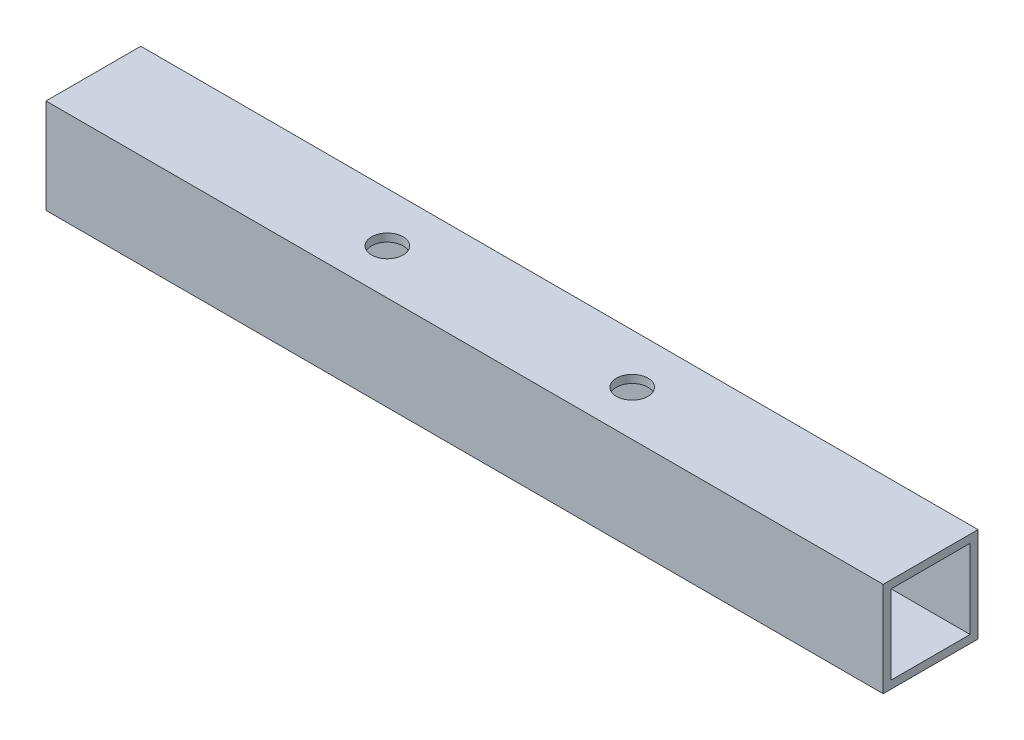
ISO-10303-21;
HEADER;
FILE_DESCRIPTION(('STEP AP214'),'2;1');
FILE_NAME('part.step','',(''),(''),'','','');
FILE_SCHEMA(('AUTOMOTIVE_DESIGN { 1 0 10303 214 1 1 1 1 }'));
ENDSEC;
DATA;
#1=APPLICATION_CONTEXT('core data for automotive mechanical design processes');
#2=APPLICATION_PROTOCOL_DEFINITION('international standard','automotive_design',2000,#1);
#3=PRODUCT_CONTEXT('',#1,'mechanical');
#4=PRODUCT('Part','Part','',(#3));
#5=PRODUCT_RELATED_PRODUCT_CATEGORY('part','',(#4));
#6=PRODUCT_DEFINITION_FORMATION('','',#4);
#7=PRODUCT_DEFINITION_CONTEXT('part definition',#1,'design');
#8=PRODUCT_DEFINITION('design','',#6,#7);
#9=PRODUCT_DEFINITION_SHAPE('','',#8);
#10=(LENGTH_UNIT() NAMED_UNIT(*) SI_UNIT(.MILLI.,.METRE.));
#11=(NAMED_UNIT(*) PLANE_ANGLE_UNIT() SI_UNIT($,.RADIAN.));
#12=(NAMED_UNIT(*) SI_UNIT($,.STERADIAN.) SOLID_ANGLE_UNIT());
#13=UNCERTAINTY_MEASURE_WITH_UNIT(LENGTH_MEASURE(1.E-05),#10,'distance_accuracy_value','');
#14=(GEOMETRIC_REPRESENTATION_CONTEXT(3) GLOBAL_UNCERTAINTY_ASSIGNED_CONTEXT((#13)) GLOBAL_UNIT_ASSIGNED_CONTEXT((#10,
#11,#12)) REPRESENTATION_CONTEXT('',''));
#15=CARTESIAN_POINT('',(0.,0.,0.));
#16=DIRECTION('',(0.,0.,1.));
#17=DIRECTION('',(1.,0.,0.));
#18=AXIS2_PLACEMENT_3D('',#15,#16,#17);
#19=CARTESIAN_POINT('',(15.5,-6.,6.2822585705839));
#20=DIRECTION('',(0.,1.,0.));
#21=DIRECTION('',(0.,0.,1.));
#22=AXIS2_PLACEMENT_3D('',#19,#20,#21);
#23=CYLINDRICAL_SURFACE('',#22,2.);
#24=CARTESIAN_POINT('',(15.5,-5.,6.2822585705839));
#25=DIRECTION('',(0.,-1.,0.));
#26=DIRECTION('',(0.,0.,-1.));
#27=AXIS2_PLACEMENT_3D('',#24,#25,#26);
#28=CIRCLE('',#27,2.);
#29=CARTESIAN_POINT('',(15.5,-5.,4.2822585705839));
#30=VERTEX_POINT('',#29);
#31=EDGE_CURVE('E134',#30,#30,#28,.F.);
#32=ORIENTED_EDGE('',*,*,#31,.T.);
#33=EDGE_LOOP('',(#32));
#34=FACE_BOUND('',#33,.T.);
#35=CARTESIAN_POINT('',(15.5,-6.,6.2822585705839));
#36=DIRECTION('',(0.,1.,0.));
#37=DIRECTION('',(0.,0.,-1.));
#38=AXIS2_PLACEMENT_3D('',#35,#36,#37);
#39=CIRCLE('',#38,2.);
#40=CARTESIAN_POINT('',(15.5,-6.,4.2822585705839));
#41=VERTEX_POINT('',#40);
#42=EDGE_CURVE('E148',#41,#41,#39,.T.);
#43=ORIENTED_EDGE('',*,*,#42,.F.);
#44=EDGE_LOOP('',(#43));
#45=FACE_BOUND('',#44,.T.);
#46=ADVANCED_FACE('F36',(#34,#45),#23,.F.);
#47=CARTESIAN_POINT('',(-15.5,-6.,6.2822585705839));
#48=DIRECTION('',(0.,1.,0.));
#49=DIRECTION('',(0.,0.,1.));
#50=AXIS2_PLACEMENT_3D('',#47,#48,#49);
#51=CYLINDRICAL_SURFACE('',#50,2.);
#52=CARTESIAN_POINT('',(-15.5,-5.,6.2822585705839));
#53=DIRECTION('',(0.,-1.,0.));
#54=DIRECTION('',(0.,0.,-1.));
#55=AXIS2_PLACEMENT_3D('',#52,#53,#54);
#56=CIRCLE('',#55,2.);
#57=CARTESIAN_POINT('',(-15.5,-5.,4.2822585705839));
#58=VERTEX_POINT('',#57);
#59=EDGE_CURVE('E133',#58,#58,#56,.F.);
#60=ORIENTED_EDGE('',*,*,#59,.T.);
#61=EDGE_LOOP('',(#60));
#62=FACE_BOUND('',#61,.T.);
#63=CARTESIAN_POINT('',(-15.5,-6.,6.2822585705839));
#64=DIRECTION('',(0.,1.,0.));
#65=DIRECTION('',(0.,0.,1.));
#66=AXIS2_PLACEMENT_3D('',#63,#64,#65);
#67=CIRCLE('',#66,2.);
#68=CARTESIAN_POINT('',(-15.5,-6.,8.2822585705839));
#69=VERTEX_POINT('',#68);
#70=EDGE_CURVE('E141',#69,#69,#67,.T.);
#71=ORIENTED_EDGE('',*,*,#70,.F.);
#72=EDGE_LOOP('',(#71));
#73=FACE_BOUND('',#72,.T.);
#74=ADVANCED_FACE('F205',(#62,#73),#51,.F.);
#75=CARTESIAN_POINT('',(53.,-6.,12.));
#76=DIRECTION('',(-1.,0.,0.));
#77=DIRECTION('',(0.,0.,1.));
#78=AXIS2_PLACEMENT_3D('',#75,#76,#77);
#79=PLANE('',#78);
#80=DIRECTION('',(0.,0.,1.));
#81=VECTOR('',#80,1.);
#82=CARTESIAN_POINT('',(53.,5.,11.));
#83=LINE('',#82,#81);
#84=CARTESIAN_POINT('',(53.,5.,1.));
#85=VERTEX_POINT('',#84);
#86=CARTESIAN_POINT('',(53.,5.,11.));
#87=VERTEX_POINT('',#86);
#88=EDGE_CURVE('E112',#85,#87,#83,.T.);
#89=ORIENTED_EDGE('',*,*,#88,.F.);
#90=DIRECTION('',(0.,1.,0.));
#91=VECTOR('',#90,1.);
#92=CARTESIAN_POINT('',(53.,5.,1.));
#93=LINE('',#92,#91);
#94=CARTESIAN_POINT('',(53.,-5.,0.999999999999997));
#95=VERTEX_POINT('',#94);
#96=EDGE_CURVE('E51',#95,#85,#93,.T.);
#97=ORIENTED_EDGE('',*,*,#96,.F.);
#98=DIRECTION('',(0.,0.,-1.));
#99=VECTOR('',#98,1.);
#100=CARTESIAN_POINT('',(53.,-5.,11.));
#101=LINE('',#100,#99);
#102=CARTESIAN_POINT('',(53.,-5.,11.));
#103=VERTEX_POINT('',#102);
#104=EDGE_CURVE('E118',#103,#95,#101,.T.);
#105=ORIENTED_EDGE('',*,*,#104,.F.);
#106=DIRECTION('',(0.,-1.,0.));
#107=VECTOR('',#106,1.);
#108=CARTESIAN_POINT('',(53.,5.,11.));
#109=LINE('',#108,#107);
#110=EDGE_CURVE('E104',#87,#103,#109,.T.);
#111=ORIENTED_EDGE('',*,*,#110,.F.);
#112=EDGE_LOOP('',(#89,#97,#105,#111));
#113=FACE_BOUND('',#112,.T.);
#114=DIRECTION('',(0.,1.,0.));
#115=VECTOR('',#114,1.);
#116=CARTESIAN_POINT('',(53.,-6.,0.));
#117=LINE('',#116,#115);
#118=CARTESIAN_POINT('',(53.,-6.,0.));
#119=VERTEX_POINT('',#118);
#120=CARTESIAN_POINT('',(53.,6.,0.));
#121=VERTEX_POINT('',#120);
#122=EDGE_CURVE('E144',#119,#121,#117,.T.);
#123=ORIENTED_EDGE('',*,*,#122,.T.);
#124=DIRECTION('',(0.,0.,-1.));
#125=VECTOR('',#124,1.);
#126=CARTESIAN_POINT('',(53.,6.,12.));
#127=LINE('',#126,#125);
#128=CARTESIAN_POINT('',(53.,6.,12.));
#129=VERTEX_POINT('',#128);
#130=EDGE_CURVE('E179',#129,#121,#127,.T.);
#131=ORIENTED_EDGE('',*,*,#130,.F.);
#132=DIRECTION('',(0.,1.,0.));
#133=VECTOR('',#132,1.);
#134=CARTESIAN_POINT('',(53.,-6.,12.));
#135=LINE('',#134,#133);
#136=CARTESIAN_POINT('',(53.,-6.,12.));
#137=VERTEX_POINT('',#136);
#138=EDGE_CURVE('E153',#137,#129,#135,.T.);
#139=ORIENTED_EDGE('',*,*,#138,.F.);
#140=DIRECTION('',(0.,0.,-1.));
#141=VECTOR('',#140,1.);
#142=CARTESIAN_POINT('',(53.,-6.,12.));
#143=LINE('',#142,#141);
#144=EDGE_CURVE('E163',#137,#119,#143,.T.);
#145=ORIENTED_EDGE('',*,*,#144,.T.);
#146=EDGE_LOOP('',(#123,#131,#139,#145));
#147=FACE_BOUND('',#146,.T.);
#148=ADVANCED_FACE('F38',(#113,#147),#79,.F.);
#149=CARTESIAN_POINT('',(-53.,6.,12.));
#150=DIRECTION('',(0.,-1.,0.));
#151=DIRECTION('',(0.,0.,-1.));
#152=AXIS2_PLACEMENT_3D('',#149,#150,#151);
#153=PLANE('',#152);
#154=CARTESIAN_POINT('',(-15.5,6.,6.2822585705839));
#155=DIRECTION('',(0.,1.,0.));
#156=DIRECTION('',(0.,0.,1.));
#157=AXIS2_PLACEMENT_3D('',#154,#155,#156);
#158=CIRCLE('',#157,2.);
#159=CARTESIAN_POINT('',(-15.5,6.,8.2822585705839));
#160=VERTEX_POINT('',#159);
#161=EDGE_CURVE('E145',#160,#160,#158,.T.);
#162=ORIENTED_EDGE('',*,*,#161,.F.);
#163=EDGE_LOOP('',(#162));
#164=FACE_BOUND('',#163,.T.);
#165=CARTESIAN_POINT('',(15.5,6.,6.2822585705839));
#166=DIRECTION('',(0.,1.,0.));
#167=DIRECTION('',(0.,0.,-1.));
#168=AXIS2_PLACEMENT_3D('',#165,#166,#167);
#169=CIRCLE('',#168,2.);
#170=CARTESIAN_POINT('',(15.5,6.,4.2822585705839));
#171=VERTEX_POINT('',#170);
#172=EDGE_CURVE('E140',#171,#171,#169,.T.);
#173=ORIENTED_EDGE('',*,*,#172,.F.);
#174=EDGE_LOOP('',(#173));
#175=FACE_BOUND('',#174,.T.);
#176=DIRECTION('',(-1.,0.,0.));
#177=VECTOR('',#176,1.);
#178=CARTESIAN_POINT('',(-53.,6.,0.));
#179=LINE('',#178,#177);
#180=CARTESIAN_POINT('',(-53.,6.,0.));
#181=VERTEX_POINT('',#180);
#182=EDGE_CURVE('E166',#121,#181,#179,.T.);
#183=ORIENTED_EDGE('',*,*,#182,.T.);
#184=DIRECTION('',(0.,0.,-1.));
#185=VECTOR('',#184,1.);
#186=CARTESIAN_POINT('',(-53.,6.,12.));
#187=LINE('',#186,#185);
#188=CARTESIAN_POINT('',(-53.,6.,12.));
#189=VERTEX_POINT('',#188);
#190=EDGE_CURVE('E176',#189,#181,#187,.T.);
#191=ORIENTED_EDGE('',*,*,#190,.F.);
#192=DIRECTION('',(-1.,0.,0.));
#193=VECTOR('',#192,1.);
#194=CARTESIAN_POINT('',(-53.,6.,12.));
#195=LINE('',#194,#193);
#196=EDGE_CURVE('E156',#129,#189,#195,.T.);
#197=ORIENTED_EDGE('',*,*,#196,.F.);
#198=ORIENTED_EDGE('',*,*,#130,.T.);
#199=EDGE_LOOP('',(#183,#191,#197,#198));
#200=FACE_BOUND('',#199,.T.);
#201=ADVANCED_FACE('F232',(#164,#175,#200),#153,.F.);
#202=CARTESIAN_POINT('',(-53.,-6.,12.));
#203=DIRECTION('',(1.,0.,0.));
#204=DIRECTION('',(0.,0.,-1.));
#205=AXIS2_PLACEMENT_3D('',#202,#203,#204);
#206=PLANE('',#205);
#207=DIRECTION('',(0.,0.,-1.));
#208=VECTOR('',#207,1.);
#209=CARTESIAN_POINT('',(-53.,-5.,12.));
#210=LINE('',#209,#208);
#211=CARTESIAN_POINT('',(-53.,-5.,11.));
#212=VERTEX_POINT('',#211);
#213=CARTESIAN_POINT('',(-53.,-5.,0.999999999999997));
#214=VERTEX_POINT('',#213);
#215=EDGE_CURVE('E137',#212,#214,#210,.T.);
#216=ORIENTED_EDGE('',*,*,#215,.T.);
#217=DIRECTION('',(0.,1.,0.));
#218=VECTOR('',#217,1.);
#219=CARTESIAN_POINT('',(-53.,-6.,0.999999999999997));
#220=LINE('',#219,#218);
#221=CARTESIAN_POINT('',(-53.,5.,1.));
#222=VERTEX_POINT('',#221);
#223=EDGE_CURVE('E11',#214,#222,#220,.T.);
#224=ORIENTED_EDGE('',*,*,#223,.T.);
#225=DIRECTION('',(0.,0.,1.));
#226=VECTOR('',#225,1.);
#227=CARTESIAN_POINT('',(-53.,5.,12.));
#228=LINE('',#227,#226);
#229=CARTESIAN_POINT('',(-53.,5.,11.));
#230=VERTEX_POINT('',#229);
#231=EDGE_CURVE('E131',#222,#230,#228,.T.);
#232=ORIENTED_EDGE('',*,*,#231,.T.);
#233=DIRECTION('',(0.,-1.,0.));
#234=VECTOR('',#233,1.);
#235=CARTESIAN_POINT('',(-53.,-6.,11.));
#236=LINE('',#235,#234);
#237=EDGE_CURVE('E44',#230,#212,#236,.T.);
#238=ORIENTED_EDGE('',*,*,#237,.T.);
#239=EDGE_LOOP('',(#216,#224,#232,#238));
#240=FACE_BOUND('',#239,.T.);
#241=DIRECTION('',(0.,-1.,0.));
#242=VECTOR('',#241,1.);
#243=CARTESIAN_POINT('',(-53.,-6.,0.));
#244=LINE('',#243,#242);
#245=CARTESIAN_POINT('',(-53.,-6.,0.));
#246=VERTEX_POINT('',#245);
#247=EDGE_CURVE('E168',#181,#246,#244,.T.);
#248=ORIENTED_EDGE('',*,*,#247,.T.);
#249=DIRECTION('',(0.,0.,-1.));
#250=VECTOR('',#249,1.);
#251=CARTESIAN_POINT('',(-53.,-6.,12.));
#252=LINE('',#251,#250);
#253=CARTESIAN_POINT('',(-53.,-6.,12.));
#254=VERTEX_POINT('',#253);
#255=EDGE_CURVE('E173',#254,#246,#252,.T.);
#256=ORIENTED_EDGE('',*,*,#255,.F.);
#257=DIRECTION('',(0.,-1.,0.));
#258=VECTOR('',#257,1.);
#259=CARTESIAN_POINT('',(-53.,-6.,12.));
#260=LINE('',#259,#258);
#261=EDGE_CURVE('E159',#189,#254,#260,.T.);
#262=ORIENTED_EDGE('',*,*,#261,.F.);
#263=ORIENTED_EDGE('',*,*,#190,.T.);
#264=EDGE_LOOP('',(#248,#256,#262,#263));
#265=FACE_BOUND('',#264,.T.);
#266=ADVANCED_FACE('F186',(#240,#265),#206,.F.);
#267=CARTESIAN_POINT('',(-53.,-6.,12.));
#268=DIRECTION('',(0.,1.,0.));
#269=DIRECTION('',(0.,0.,1.));
#270=AXIS2_PLACEMENT_3D('',#267,#268,#269);
#271=PLANE('',#270);
#272=ORIENTED_EDGE('',*,*,#70,.T.);
#273=EDGE_LOOP('',(#272));
#274=FACE_BOUND('',#273,.T.);
#275=ORIENTED_EDGE('',*,*,#42,.T.);
#276=EDGE_LOOP('',(#275));
#277=FACE_BOUND('',#276,.T.);
#278=DIRECTION('',(1.,0.,0.));
#279=VECTOR('',#278,1.);
#280=CARTESIAN_POINT('',(-53.,-6.,0.));
#281=LINE('',#280,#279);
#282=EDGE_CURVE('E157',#246,#119,#281,.T.);
#283=ORIENTED_EDGE('',*,*,#282,.T.);
#284=ORIENTED_EDGE('',*,*,#144,.F.);
#285=DIRECTION('',(1.,0.,0.));
#286=VECTOR('',#285,1.);
#287=CARTESIAN_POINT('',(-53.,-6.,12.));
#288=LINE('',#287,#286);
#289=EDGE_CURVE('E161',#254,#137,#288,.T.);
#290=ORIENTED_EDGE('',*,*,#289,.F.);
#291=ORIENTED_EDGE('',*,*,#255,.T.);
#292=EDGE_LOOP('',(#283,#284,#290,#291));
#293=FACE_BOUND('',#292,.T.);
#294=ADVANCED_FACE('F245',(#274,#277,#293),#271,.F.);
#295=CARTESIAN_POINT('',(0.,0.,12.));
#296=DIRECTION('',(0.,0.,-1.));
#297=DIRECTION('',(-1.,0.,0.));
#298=AXIS2_PLACEMENT_3D('',#295,#296,#297);
#299=PLANE('',#298);
#300=ORIENTED_EDGE('',*,*,#138,.T.);
#301=ORIENTED_EDGE('',*,*,#196,.T.);
#302=ORIENTED_EDGE('',*,*,#261,.T.);
#303=ORIENTED_EDGE('',*,*,#289,.T.);
#304=EDGE_LOOP('',(#300,#301,#302,#303));
#305=FACE_BOUND('',#304,.T.);
#306=ADVANCED_FACE('F225',(#305),#299,.F.);
#307=CARTESIAN_POINT('',(0.,0.,0.));
#308=DIRECTION('',(0.,0.,-1.));
#309=DIRECTION('',(-1.,0.,0.));
#310=AXIS2_PLACEMENT_3D('',#307,#308,#309);
#311=PLANE('',#310);
#312=ORIENTED_EDGE('',*,*,#122,.F.);
#313=ORIENTED_EDGE('',*,*,#282,.F.);
#314=ORIENTED_EDGE('',*,*,#247,.F.);
#315=ORIENTED_EDGE('',*,*,#182,.F.);
#316=EDGE_LOOP('',(#312,#313,#314,#315));
#317=FACE_BOUND('',#316,.T.);
#318=ADVANCED_FACE('F218',(#317),#311,.T.);
#319=CARTESIAN_POINT('',(15.5,5.,6.2822585705839));
#320=DIRECTION('',(0.,1.,0.));
#321=DIRECTION('',(0.,0.,1.));
#322=AXIS2_PLACEMENT_3D('',#319,#320,#321);
#323=CIRCLE('',#322,2.);
#324=CARTESIAN_POINT('',(15.5,5.,8.2822585705839));
#325=VERTEX_POINT('',#324);
#326=EDGE_CURVE('E128',#325,#325,#323,.F.);
#327=ORIENTED_EDGE('',*,*,#326,.T.);
#328=EDGE_LOOP('',(#327));
#329=FACE_BOUND('',#328,.T.);
#330=ORIENTED_EDGE('',*,*,#172,.T.);
#331=EDGE_LOOP('',(#330));
#332=FACE_BOUND('',#331,.T.);
#333=ADVANCED_FACE('F208',(#329,#332),#23,.F.);
#334=CARTESIAN_POINT('',(-15.5,5.,6.2822585705839));
#335=DIRECTION('',(0.,1.,0.));
#336=DIRECTION('',(0.,0.,1.));
#337=AXIS2_PLACEMENT_3D('',#334,#335,#336);
#338=CIRCLE('',#337,2.);
#339=CARTESIAN_POINT('',(-15.5,5.,8.2822585705839));
#340=VERTEX_POINT('',#339);
#341=EDGE_CURVE('E125',#340,#340,#338,.F.);
#342=ORIENTED_EDGE('',*,*,#341,.T.);
#343=EDGE_LOOP('',(#342));
#344=FACE_BOUND('',#343,.T.);
#345=ORIENTED_EDGE('',*,*,#161,.T.);
#346=EDGE_LOOP('',(#345));
#347=FACE_BOUND('',#346,.T.);
#348=ADVANCED_FACE('F214',(#344,#347),#51,.F.);
#349=CARTESIAN_POINT('',(-75.,5.,1.));
#350=DIRECTION('',(0.,0.,-1.));
#351=DIRECTION('',(0.,1.,0.));
#352=AXIS2_PLACEMENT_3D('',#349,#350,#351);
#353=PLANE('',#352);
#354=DIRECTION('',(1.,0.,0.));
#355=VECTOR('',#354,1.);
#356=CARTESIAN_POINT('',(-75.,-5.,0.999999999999997));
#357=LINE('',#356,#355);
#358=EDGE_CURVE('E123',#214,#95,#357,.T.);
#359=ORIENTED_EDGE('',*,*,#358,.T.);
#360=ORIENTED_EDGE('',*,*,#96,.T.);
#361=DIRECTION('',(1.,0.,0.));
#362=VECTOR('',#361,1.);
#363=CARTESIAN_POINT('',(-75.,5.,1.));
#364=LINE('',#363,#362);
#365=EDGE_CURVE('E109',#222,#85,#364,.T.);
#366=ORIENTED_EDGE('',*,*,#365,.F.);
#367=ORIENTED_EDGE('',*,*,#223,.F.);
#368=EDGE_LOOP('',(#359,#360,#366,#367));
#369=FACE_BOUND('',#368,.T.);
#370=ADVANCED_FACE('F188',(#369),#353,.F.);
#371=CARTESIAN_POINT('',(-75.,5.,11.));
#372=DIRECTION('',(0.,0.,1.));
#373=DIRECTION('',(0.,-1.,0.));
#374=AXIS2_PLACEMENT_3D('',#371,#372,#373);
#375=PLANE('',#374);
#376=DIRECTION('',(1.,0.,0.));
#377=VECTOR('',#376,1.);
#378=CARTESIAN_POINT('',(-75.,5.,11.));
#379=LINE('',#378,#377);
#380=EDGE_CURVE('E59',#230,#87,#379,.T.);
#381=ORIENTED_EDGE('',*,*,#380,.T.);
#382=ORIENTED_EDGE('',*,*,#110,.T.);
#383=DIRECTION('',(1.,0.,0.));
#384=VECTOR('',#383,1.);
#385=CARTESIAN_POINT('',(-75.,-5.,11.));
#386=LINE('',#385,#384);
#387=EDGE_CURVE('E108',#212,#103,#386,.T.);
#388=ORIENTED_EDGE('',*,*,#387,.F.);
#389=ORIENTED_EDGE('',*,*,#237,.F.);
#390=EDGE_LOOP('',(#381,#382,#388,#389));
#391=FACE_BOUND('',#390,.T.);
#392=ADVANCED_FACE('F101',(#391),#375,.F.);
#393=CARTESIAN_POINT('',(-75.,-5.,11.));
#394=DIRECTION('',(0.,-1.,0.));
#395=DIRECTION('',(0.,0.,-1.));
#396=AXIS2_PLACEMENT_3D('',#393,#394,#395);
#397=PLANE('',#396);
#398=ORIENTED_EDGE('',*,*,#59,.F.);
#399=EDGE_LOOP('',(#398));
#400=FACE_BOUND('',#399,.T.);
#401=ORIENTED_EDGE('',*,*,#31,.F.);
#402=EDGE_LOOP('',(#401));
#403=FACE_BOUND('',#402,.T.);
#404=ORIENTED_EDGE('',*,*,#387,.T.);
#405=ORIENTED_EDGE('',*,*,#104,.T.);
#406=ORIENTED_EDGE('',*,*,#358,.F.);
#407=ORIENTED_EDGE('',*,*,#215,.F.);
#408=EDGE_LOOP('',(#404,#405,#406,#407));
#409=FACE_BOUND('',#408,.T.);
#410=ADVANCED_FACE('F191',(#400,#403,#409),#397,.F.);
#411=CARTESIAN_POINT('',(-75.,5.,11.));
#412=DIRECTION('',(0.,1.,0.));
#413=DIRECTION('',(0.,0.,1.));
#414=AXIS2_PLACEMENT_3D('',#411,#412,#413);
#415=PLANE('',#414);
#416=ORIENTED_EDGE('',*,*,#341,.F.);
#417=EDGE_LOOP('',(#416));
#418=FACE_BOUND('',#417,.T.);
#419=ORIENTED_EDGE('',*,*,#326,.F.);
#420=EDGE_LOOP('',(#419));
#421=FACE_BOUND('',#420,.T.);
#422=ORIENTED_EDGE('',*,*,#365,.T.);
#423=ORIENTED_EDGE('',*,*,#88,.T.);
#424=ORIENTED_EDGE('',*,*,#380,.F.);
#425=ORIENTED_EDGE('',*,*,#231,.F.);
#426=EDGE_LOOP('',(#422,#423,#424,#425));
#427=FACE_BOUND('',#426,.T.);
#428=ADVANCED_FACE('F113',(#418,#421,#427),#415,.F.);
#429=CLOSED_SHELL('',(#46,#74,#148,#201,#266,#294,#306,#318,#333,#348,#370,#392,#410,#428));
#430=MANIFOLD_SOLID_BREP('B2',#429);
#431=ADVANCED_BREP_SHAPE_REPRESENTATION('',(#18,#430),#14);
#432=SHAPE_DEFINITION_REPRESENTATION(#9,#431);
ENDSEC;
END-ISO-10303-21;
